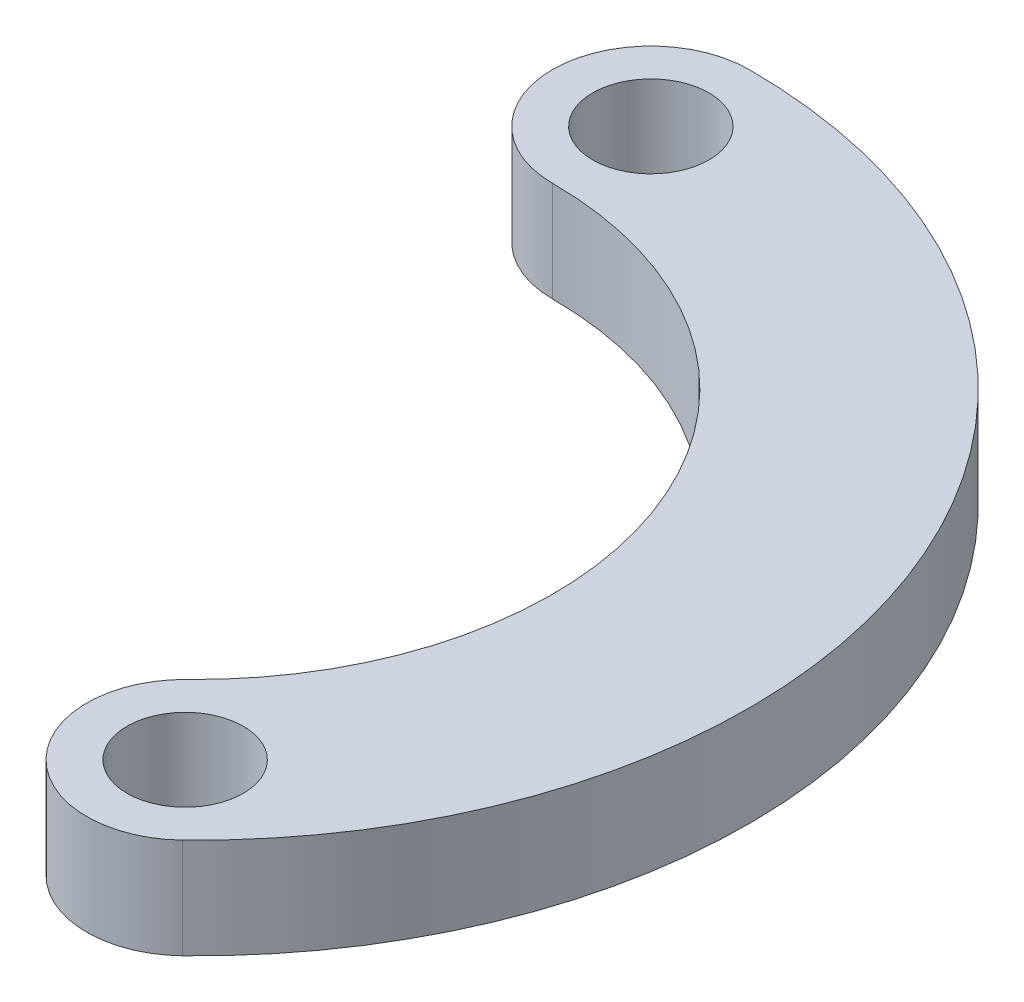
ISO-10303-21;
HEADER;
FILE_DESCRIPTION(('STEP AP214'),'2;1');
FILE_NAME('part.step','',(''),(''),'','','');
FILE_SCHEMA(('AUTOMOTIVE_DESIGN { 1 0 10303 214 1 1 1 1 }'));
ENDSEC;
DATA;
#1=APPLICATION_CONTEXT('core data for automotive mechanical design processes');
#2=APPLICATION_PROTOCOL_DEFINITION('international standard','automotive_design',2000,#1);
#3=PRODUCT_CONTEXT('',#1,'mechanical');
#4=PRODUCT('Part','Part','',(#3));
#5=PRODUCT_RELATED_PRODUCT_CATEGORY('part','',(#4));
#6=PRODUCT_DEFINITION_FORMATION('','',#4);
#7=PRODUCT_DEFINITION_CONTEXT('part definition',#1,'design');
#8=PRODUCT_DEFINITION('design','',#6,#7);
#9=PRODUCT_DEFINITION_SHAPE('','',#8);
#10=(LENGTH_UNIT() NAMED_UNIT(*) SI_UNIT(.MILLI.,.METRE.));
#11=(NAMED_UNIT(*) PLANE_ANGLE_UNIT() SI_UNIT($,.RADIAN.));
#12=(NAMED_UNIT(*) SI_UNIT($,.STERADIAN.) SOLID_ANGLE_UNIT());
#13=UNCERTAINTY_MEASURE_WITH_UNIT(LENGTH_MEASURE(1.E-05),#10,'distance_accuracy_value','');
#14=(GEOMETRIC_REPRESENTATION_CONTEXT(3) GLOBAL_UNCERTAINTY_ASSIGNED_CONTEXT((#13)) GLOBAL_UNIT_ASSIGNED_CONTEXT((#10,
#11,#12)) REPRESENTATION_CONTEXT('',''));
#15=CARTESIAN_POINT('',(0.,0.,0.));
#16=DIRECTION('',(0.,0.,1.));
#17=DIRECTION('',(1.,0.,0.));
#18=AXIS2_PLACEMENT_3D('',#15,#16,#17);
#19=CARTESIAN_POINT('',(0.,-2.8,0.));
#20=DIRECTION('',(0.,1.,0.));
#21=DIRECTION('',(0.,0.,1.));
#22=AXIS2_PLACEMENT_3D('',#19,#20,#21);
#23=CYLINDRICAL_SURFACE('',#22,9.95);
#24=CARTESIAN_POINT('',(0.,0.,0.));
#25=DIRECTION('',(0.,1.,0.));
#26=DIRECTION('',(0.,0.,1.));
#27=AXIS2_PLACEMENT_3D('',#24,#25,#26);
#28=CIRCLE('',#27,9.95);
#29=CARTESIAN_POINT('',(6.91185078606699,0.,7.15743101336961));
#30=VERTEX_POINT('',#29);
#31=CARTESIAN_POINT('',(0.,0.,-9.95));
#32=VERTEX_POINT('',#31);
#33=EDGE_CURVE('E112',#30,#32,#28,.T.);
#34=ORIENTED_EDGE('',*,*,#33,.T.);
#35=DIRECTION('',(0.,1.,0.));
#36=VECTOR('',#35,1.);
#37=CARTESIAN_POINT('',(0.,-2.8,-9.95));
#38=LINE('',#37,#36);
#39=CARTESIAN_POINT('',(0.,-2.8,-9.95));
#40=VERTEX_POINT('',#39);
#41=EDGE_CURVE('E13',#40,#32,#38,.T.);
#42=ORIENTED_EDGE('',*,*,#41,.F.);
#43=CARTESIAN_POINT('',(0.,-2.8,0.));
#44=DIRECTION('',(0.,1.,0.));
#45=DIRECTION('',(0.,0.,1.));
#46=AXIS2_PLACEMENT_3D('',#43,#44,#45);
#47=CIRCLE('',#46,9.95);
#48=CARTESIAN_POINT('',(6.91185078606699,-2.8,7.15743101336961));
#49=VERTEX_POINT('',#48);
#50=EDGE_CURVE('E66',#49,#40,#47,.T.);
#51=ORIENTED_EDGE('',*,*,#50,.F.);
#52=DIRECTION('',(0.,1.,0.));
#53=VECTOR('',#52,1.);
#54=CARTESIAN_POINT('',(6.91185078606699,-2.8,7.15743101336961));
#55=LINE('',#54,#53);
#56=EDGE_CURVE('E51',#49,#30,#55,.T.);
#57=ORIENTED_EDGE('',*,*,#56,.T.);
#58=EDGE_LOOP('',(#34,#42,#51,#57));
#59=FACE_BOUND('',#58,.T.);
#60=ADVANCED_FACE('F48',(#59),#23,.F.);
#61=CARTESIAN_POINT('',(0.,-2.8,-12.7));
#62=DIRECTION('',(0.,1.,0.));
#63=DIRECTION('',(0.,0.,1.));
#64=AXIS2_PLACEMENT_3D('',#61,#62,#63);
#65=CYLINDRICAL_SURFACE('',#64,2.75);
#66=CARTESIAN_POINT('',(0.,0.,-12.7));
#67=DIRECTION('',(0.,1.,0.));
#68=DIRECTION('',(0.,0.,1.));
#69=AXIS2_PLACEMENT_3D('',#66,#67,#68);
#70=CIRCLE('',#69,2.75);
#71=CARTESIAN_POINT('',(0.,0.,-15.45));
#72=VERTEX_POINT('',#71);
#73=EDGE_CURVE('E107',#72,#32,#70,.T.);
#74=ORIENTED_EDGE('',*,*,#73,.F.);
#75=DIRECTION('',(0.,1.,0.));
#76=VECTOR('',#75,1.);
#77=CARTESIAN_POINT('',(0.,-2.8,-15.45));
#78=LINE('',#77,#76);
#79=CARTESIAN_POINT('',(0.,-2.8,-15.45));
#80=VERTEX_POINT('',#79);
#81=EDGE_CURVE('E57',#80,#72,#78,.T.);
#82=ORIENTED_EDGE('',*,*,#81,.F.);
#83=CARTESIAN_POINT('',(0.,-2.8,-12.7));
#84=DIRECTION('',(0.,1.,0.));
#85=DIRECTION('',(0.,0.,1.));
#86=AXIS2_PLACEMENT_3D('',#83,#84,#85);
#87=CIRCLE('',#86,2.75);
#88=EDGE_CURVE('E103',#80,#40,#87,.T.);
#89=ORIENTED_EDGE('',*,*,#88,.T.);
#90=ORIENTED_EDGE('',*,*,#41,.T.);
#91=EDGE_LOOP('',(#74,#82,#89,#90));
#92=FACE_BOUND('',#91,.T.);
#93=ADVANCED_FACE('F123',(#92),#65,.T.);
#94=CARTESIAN_POINT('',(0.,-2.8,0.));
#95=DIRECTION('',(0.,1.,0.));
#96=DIRECTION('',(0.,0.,1.));
#97=AXIS2_PLACEMENT_3D('',#94,#95,#96);
#98=CYLINDRICAL_SURFACE('',#97,15.45);
#99=CARTESIAN_POINT('',(0.,0.,0.));
#100=DIRECTION('',(0.,1.,0.));
#101=DIRECTION('',(0.,0.,1.));
#102=AXIS2_PLACEMENT_3D('',#99,#100,#101);
#103=CIRCLE('',#102,15.45);
#104=CARTESIAN_POINT('',(10.7324718235915,0.,11.1137999152322));
#105=VERTEX_POINT('',#104);
#106=EDGE_CURVE('E99',#105,#72,#103,.T.);
#107=ORIENTED_EDGE('',*,*,#106,.F.);
#108=DIRECTION('',(0.,1.,0.));
#109=VECTOR('',#108,1.);
#110=CARTESIAN_POINT('',(10.7324718235915,-2.8,11.1137999152322));
#111=LINE('',#110,#109);
#112=CARTESIAN_POINT('',(10.7324718235915,-2.8,11.1137999152322));
#113=VERTEX_POINT('',#112);
#114=EDGE_CURVE('E95',#113,#105,#111,.T.);
#115=ORIENTED_EDGE('',*,*,#114,.F.);
#116=CARTESIAN_POINT('',(0.,-2.8,0.));
#117=DIRECTION('',(0.,1.,0.));
#118=DIRECTION('',(0.,0.,1.));
#119=AXIS2_PLACEMENT_3D('',#116,#117,#118);
#120=CIRCLE('',#119,15.45);
#121=EDGE_CURVE('E98',#113,#80,#120,.T.);
#122=ORIENTED_EDGE('',*,*,#121,.T.);
#123=ORIENTED_EDGE('',*,*,#81,.T.);
#124=EDGE_LOOP('',(#107,#115,#122,#123));
#125=FACE_BOUND('',#124,.T.);
#126=ADVANCED_FACE('F97',(#125),#98,.T.);
#127=CARTESIAN_POINT('',(8.82216130482922,-2.8,9.13561546430091));
#128=DIRECTION('',(0.,1.,0.));
#129=DIRECTION('',(0.,0.,1.));
#130=AXIS2_PLACEMENT_3D('',#127,#128,#129);
#131=CYLINDRICAL_SURFACE('',#130,2.75);
#132=CARTESIAN_POINT('',(8.82216130482922,0.,9.13561546430091));
#133=DIRECTION('',(0.,1.,0.));
#134=DIRECTION('',(0.,0.,1.));
#135=AXIS2_PLACEMENT_3D('',#132,#133,#134);
#136=CIRCLE('',#135,2.75);
#137=EDGE_CURVE('E114',#30,#105,#136,.T.);
#138=ORIENTED_EDGE('',*,*,#137,.F.);
#139=ORIENTED_EDGE('',*,*,#56,.F.);
#140=CARTESIAN_POINT('',(8.82216130482922,-2.8,9.13561546430091));
#141=DIRECTION('',(0.,1.,0.));
#142=DIRECTION('',(0.,0.,1.));
#143=AXIS2_PLACEMENT_3D('',#140,#141,#142);
#144=CIRCLE('',#143,2.75);
#145=EDGE_CURVE('E102',#49,#113,#144,.T.);
#146=ORIENTED_EDGE('',*,*,#145,.T.);
#147=ORIENTED_EDGE('',*,*,#114,.T.);
#148=EDGE_LOOP('',(#138,#139,#146,#147));
#149=FACE_BOUND('',#148,.T.);
#150=ADVANCED_FACE('F105',(#149),#131,.T.);
#151=CARTESIAN_POINT('',(0.,-2.8,0.));
#152=DIRECTION('',(0.,1.,0.));
#153=DIRECTION('',(0.,0.,1.));
#154=AXIS2_PLACEMENT_3D('',#151,#152,#153);
#155=PLANE('',#154);
#156=CARTESIAN_POINT('',(0.,-2.8,-12.7));
#157=DIRECTION('',(0.,1.,0.));
#158=DIRECTION('',(0.,0.,1.));
#159=AXIS2_PLACEMENT_3D('',#156,#157,#158);
#160=CIRCLE('',#159,1.625);
#161=CARTESIAN_POINT('',(0.,-2.8,-11.075));
#162=VERTEX_POINT('',#161);
#163=EDGE_CURVE('E115',#162,#162,#160,.T.);
#164=ORIENTED_EDGE('',*,*,#163,.T.);
#165=EDGE_LOOP('',(#164));
#166=FACE_BOUND('',#165,.T.);
#167=CARTESIAN_POINT('',(8.82216130482922,-2.8,9.13561546430091));
#168=DIRECTION('',(0.,1.,0.));
#169=DIRECTION('',(0.,0.,1.));
#170=AXIS2_PLACEMENT_3D('',#167,#168,#169);
#171=CIRCLE('',#170,1.625);
#172=CARTESIAN_POINT('',(8.82216130482922,-2.8,10.7606154643009));
#173=VERTEX_POINT('',#172);
#174=EDGE_CURVE('E160',#173,#173,#171,.T.);
#175=ORIENTED_EDGE('',*,*,#174,.T.);
#176=EDGE_LOOP('',(#175));
#177=FACE_BOUND('',#176,.T.);
#178=ORIENTED_EDGE('',*,*,#50,.T.);
#179=ORIENTED_EDGE('',*,*,#88,.F.);
#180=ORIENTED_EDGE('',*,*,#121,.F.);
#181=ORIENTED_EDGE('',*,*,#145,.F.);
#182=EDGE_LOOP('',(#178,#179,#180,#181));
#183=FACE_BOUND('',#182,.T.);
#184=ADVANCED_FACE('F101',(#166,#177,#183),#155,.F.);
#185=CARTESIAN_POINT('',(0.,0.,0.));
#186=DIRECTION('',(0.,1.,0.));
#187=DIRECTION('',(0.,0.,1.));
#188=AXIS2_PLACEMENT_3D('',#185,#186,#187);
#189=PLANE('',#188);
#190=CARTESIAN_POINT('',(0.,0.,-12.7));
#191=DIRECTION('',(0.,1.,0.));
#192=DIRECTION('',(0.,0.,1.));
#193=AXIS2_PLACEMENT_3D('',#190,#191,#192);
#194=CIRCLE('',#193,1.625);
#195=CARTESIAN_POINT('',(0.,0.,-11.075));
#196=VERTEX_POINT('',#195);
#197=EDGE_CURVE('E159',#196,#196,#194,.T.);
#198=ORIENTED_EDGE('',*,*,#197,.F.);
#199=EDGE_LOOP('',(#198));
#200=FACE_BOUND('',#199,.T.);
#201=CARTESIAN_POINT('',(8.82216130482922,0.,9.13561546430091));
#202=DIRECTION('',(0.,1.,0.));
#203=DIRECTION('',(0.,0.,1.));
#204=AXIS2_PLACEMENT_3D('',#201,#202,#203);
#205=CIRCLE('',#204,1.625);
#206=CARTESIAN_POINT('',(8.82216130482922,0.,10.7606154643009));
#207=VERTEX_POINT('',#206);
#208=EDGE_CURVE('E164',#207,#207,#205,.T.);
#209=ORIENTED_EDGE('',*,*,#208,.F.);
#210=EDGE_LOOP('',(#209));
#211=FACE_BOUND('',#210,.T.);
#212=ORIENTED_EDGE('',*,*,#33,.F.);
#213=ORIENTED_EDGE('',*,*,#137,.T.);
#214=ORIENTED_EDGE('',*,*,#106,.T.);
#215=ORIENTED_EDGE('',*,*,#73,.T.);
#216=EDGE_LOOP('',(#212,#213,#214,#215));
#217=FACE_BOUND('',#216,.T.);
#218=ADVANCED_FACE('F122',(#200,#211,#217),#189,.T.);
#219=CARTESIAN_POINT('',(8.82216130482922,-2.8,9.13561546430091));
#220=DIRECTION('',(0.,1.,0.));
#221=DIRECTION('',(0.,0.,1.));
#222=AXIS2_PLACEMENT_3D('',#219,#220,#221);
#223=CYLINDRICAL_SURFACE('',#222,1.625);
#224=ORIENTED_EDGE('',*,*,#174,.F.);
#225=EDGE_LOOP('',(#224));
#226=FACE_BOUND('',#225,.T.);
#227=ORIENTED_EDGE('',*,*,#208,.T.);
#228=EDGE_LOOP('',(#227));
#229=FACE_BOUND('',#228,.T.);
#230=ADVANCED_FACE('F142',(#226,#229),#223,.F.);
#231=CARTESIAN_POINT('',(0.,-2.8,-12.7));
#232=DIRECTION('',(0.,1.,0.));
#233=DIRECTION('',(0.,0.,1.));
#234=AXIS2_PLACEMENT_3D('',#231,#232,#233);
#235=CYLINDRICAL_SURFACE('',#234,1.625);
#236=ORIENTED_EDGE('',*,*,#163,.F.);
#237=EDGE_LOOP('',(#236));
#238=FACE_BOUND('',#237,.T.);
#239=ORIENTED_EDGE('',*,*,#197,.T.);
#240=EDGE_LOOP('',(#239));
#241=FACE_BOUND('',#240,.T.);
#242=ADVANCED_FACE('F149',(#238,#241),#235,.F.);
#243=CLOSED_SHELL('',(#60,#93,#126,#150,#184,#218,#230,#242));
#244=MANIFOLD_SOLID_BREP('B2',#243);
#245=ADVANCED_BREP_SHAPE_REPRESENTATION('',(#18,#244),#14);
#246=SHAPE_DEFINITION_REPRESENTATION(#9,#245);
ENDSEC;
END-ISO-10303-21;
